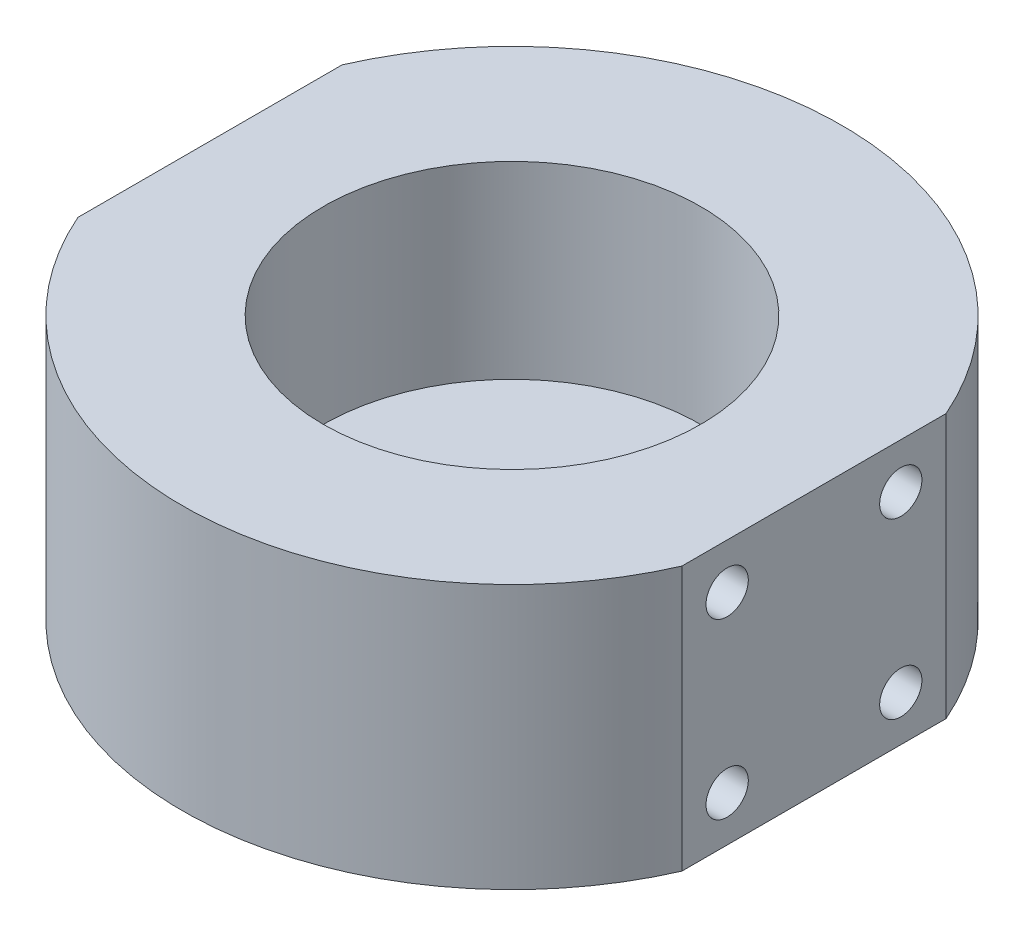
ISO-10303-21;
HEADER;
FILE_DESCRIPTION(('STEP AP214'),'2;1');
FILE_NAME('part.step','',(''),(''),'','','');
FILE_SCHEMA(('AUTOMOTIVE_DESIGN { 1 0 10303 214 1 1 1 1 }'));
ENDSEC;
DATA;
#1=APPLICATION_CONTEXT('core data for automotive mechanical design processes');
#2=APPLICATION_PROTOCOL_DEFINITION('international standard','automotive_design',2000,#1);
#3=PRODUCT_CONTEXT('',#1,'mechanical');
#4=PRODUCT('Part','Part','',(#3));
#5=PRODUCT_RELATED_PRODUCT_CATEGORY('part','',(#4));
#6=PRODUCT_DEFINITION_FORMATION('','',#4);
#7=PRODUCT_DEFINITION_CONTEXT('part definition',#1,'design');
#8=PRODUCT_DEFINITION('design','',#6,#7);
#9=PRODUCT_DEFINITION_SHAPE('','',#8);
#10=(LENGTH_UNIT() NAMED_UNIT(*) SI_UNIT(.MILLI.,.METRE.));
#11=(NAMED_UNIT(*) PLANE_ANGLE_UNIT() SI_UNIT($,.RADIAN.));
#12=(NAMED_UNIT(*) SI_UNIT($,.STERADIAN.) SOLID_ANGLE_UNIT());
#13=UNCERTAINTY_MEASURE_WITH_UNIT(LENGTH_MEASURE(1.E-05),#10,'distance_accuracy_value','');
#14=(GEOMETRIC_REPRESENTATION_CONTEXT(3) GLOBAL_UNCERTAINTY_ASSIGNED_CONTEXT((#13)) GLOBAL_UNIT_ASSIGNED_CONTEXT((#10,
#11,#12)) REPRESENTATION_CONTEXT('',''));
#15=CARTESIAN_POINT('',(0.,0.,0.));
#16=DIRECTION('',(0.,0.,1.));
#17=DIRECTION('',(1.,0.,0.));
#18=AXIS2_PLACEMENT_3D('',#15,#16,#17);
#19=CARTESIAN_POINT('',(0.,0.,-9.));
#20=DIRECTION('',(0.,1.,0.));
#21=DIRECTION('',(0.,0.,1.));
#22=AXIS2_PLACEMENT_3D('',#19,#20,#21);
#23=CYLINDRICAL_SURFACE('',#22,1.69);
#24=CARTESIAN_POINT('',(0.,0.,-9.));
#25=DIRECTION('',(0.,1.,0.));
#26=DIRECTION('',(0.,0.,1.));
#27=AXIS2_PLACEMENT_3D('',#24,#25,#26);
#28=CIRCLE('',#27,1.69);
#29=CARTESIAN_POINT('',(0.,0.,-7.31));
#30=VERTEX_POINT('',#29);
#31=EDGE_CURVE('E172',#30,#30,#28,.T.);
#32=ORIENTED_EDGE('',*,*,#31,.F.);
#33=EDGE_LOOP('',(#32));
#34=FACE_BOUND('',#33,.T.);
#35=CARTESIAN_POINT('',(0.,10.,-9.));
#36=DIRECTION('',(0.,1.,0.));
#37=DIRECTION('',(0.,0.,1.));
#38=AXIS2_PLACEMENT_3D('',#35,#36,#37);
#39=CIRCLE('',#38,1.69);
#40=CARTESIAN_POINT('',(0.,10.,-7.31));
#41=VERTEX_POINT('',#40);
#42=EDGE_CURVE('E179',#41,#41,#39,.F.);
#43=ORIENTED_EDGE('',*,*,#42,.F.);
#44=EDGE_LOOP('',(#43));
#45=FACE_BOUND('',#44,.T.);
#46=ADVANCED_FACE('F41',(#34,#45),#23,.F.);
#47=CARTESIAN_POINT('',(0.,0.,9.));
#48=DIRECTION('',(0.,1.,0.));
#49=DIRECTION('',(0.,0.,1.));
#50=AXIS2_PLACEMENT_3D('',#47,#48,#49);
#51=CYLINDRICAL_SURFACE('',#50,1.69);
#52=CARTESIAN_POINT('',(0.,0.,9.));
#53=DIRECTION('',(0.,1.,0.));
#54=DIRECTION('',(0.,0.,1.));
#55=AXIS2_PLACEMENT_3D('',#52,#53,#54);
#56=CIRCLE('',#55,1.69);
#57=CARTESIAN_POINT('',(0.,0.,10.69));
#58=VERTEX_POINT('',#57);
#59=EDGE_CURVE('E169',#58,#58,#56,.T.);
#60=ORIENTED_EDGE('',*,*,#59,.F.);
#61=EDGE_LOOP('',(#60));
#62=FACE_BOUND('',#61,.T.);
#63=CARTESIAN_POINT('',(0.,10.,9.));
#64=DIRECTION('',(0.,1.,0.));
#65=DIRECTION('',(0.,0.,1.));
#66=AXIS2_PLACEMENT_3D('',#63,#64,#65);
#67=CIRCLE('',#66,1.69);
#68=CARTESIAN_POINT('',(0.,10.,10.69));
#69=VERTEX_POINT('',#68);
#70=EDGE_CURVE('E186',#69,#69,#67,.F.);
#71=ORIENTED_EDGE('',*,*,#70,.F.);
#72=EDGE_LOOP('',(#71));
#73=FACE_BOUND('',#72,.T.);
#74=ADVANCED_FACE('F219',(#62,#73),#51,.F.);
#75=CARTESIAN_POINT('',(-6.,0.,0.));
#76=DIRECTION('',(0.,1.,0.));
#77=DIRECTION('',(0.,0.,1.));
#78=AXIS2_PLACEMENT_3D('',#75,#76,#77);
#79=CYLINDRICAL_SURFACE('',#78,1.69);
#80=CARTESIAN_POINT('',(-6.,0.,0.));
#81=DIRECTION('',(0.,1.,0.));
#82=DIRECTION('',(0.,0.,1.));
#83=AXIS2_PLACEMENT_3D('',#80,#81,#82);
#84=CIRCLE('',#83,1.69);
#85=CARTESIAN_POINT('',(-6.,0.,1.69));
#86=VERTEX_POINT('',#85);
#87=EDGE_CURVE('E173',#86,#86,#84,.T.);
#88=ORIENTED_EDGE('',*,*,#87,.F.);
#89=EDGE_LOOP('',(#88));
#90=FACE_BOUND('',#89,.T.);
#91=CARTESIAN_POINT('',(-6.,10.,0.));
#92=DIRECTION('',(0.,1.,0.));
#93=DIRECTION('',(0.,0.,1.));
#94=AXIS2_PLACEMENT_3D('',#91,#92,#93);
#95=CIRCLE('',#94,1.69);
#96=CARTESIAN_POINT('',(-6.,10.,1.69));
#97=VERTEX_POINT('',#96);
#98=EDGE_CURVE('E189',#97,#97,#95,.F.);
#99=ORIENTED_EDGE('',*,*,#98,.F.);
#100=EDGE_LOOP('',(#99));
#101=FACE_BOUND('',#100,.T.);
#102=ADVANCED_FACE('F225',(#90,#101),#79,.F.);
#103=CARTESIAN_POINT('',(0.,0.,0.));
#104=DIRECTION('',(0.,1.,0.));
#105=DIRECTION('',(0.,0.,1.));
#106=AXIS2_PLACEMENT_3D('',#103,#104,#105);
#107=CYLINDRICAL_SURFACE('',#106,2.25);
#108=CARTESIAN_POINT('',(0.,0.,0.));
#109=DIRECTION('',(0.,1.,0.));
#110=DIRECTION('',(0.,0.,1.));
#111=AXIS2_PLACEMENT_3D('',#108,#109,#110);
#112=CIRCLE('',#111,2.25);
#113=CARTESIAN_POINT('',(0.,0.,2.25));
#114=VERTEX_POINT('',#113);
#115=EDGE_CURVE('E176',#114,#114,#112,.T.);
#116=ORIENTED_EDGE('',*,*,#115,.F.);
#117=EDGE_LOOP('',(#116));
#118=FACE_BOUND('',#117,.T.);
#119=CARTESIAN_POINT('',(0.,10.,0.));
#120=DIRECTION('',(0.,1.,0.));
#121=DIRECTION('',(0.,0.,1.));
#122=AXIS2_PLACEMENT_3D('',#119,#120,#121);
#123=CIRCLE('',#122,2.25);
#124=CARTESIAN_POINT('',(0.,10.,2.25));
#125=VERTEX_POINT('',#124);
#126=EDGE_CURVE('E192',#125,#125,#123,.F.);
#127=ORIENTED_EDGE('',*,*,#126,.F.);
#128=EDGE_LOOP('',(#127));
#129=FACE_BOUND('',#128,.T.);
#130=ADVANCED_FACE('F231',(#118,#129),#107,.F.);
#131=CARTESIAN_POINT('',(6.,0.,0.));
#132=DIRECTION('',(0.,1.,0.));
#133=DIRECTION('',(0.,0.,1.));
#134=AXIS2_PLACEMENT_3D('',#131,#132,#133);
#135=CYLINDRICAL_SURFACE('',#134,1.69);
#136=CARTESIAN_POINT('',(6.,0.,0.));
#137=DIRECTION('',(0.,1.,0.));
#138=DIRECTION('',(0.,0.,1.));
#139=AXIS2_PLACEMENT_3D('',#136,#137,#138);
#140=CIRCLE('',#139,1.69);
#141=CARTESIAN_POINT('',(6.,0.,1.69));
#142=VERTEX_POINT('',#141);
#143=EDGE_CURVE('E166',#142,#142,#140,.T.);
#144=ORIENTED_EDGE('',*,*,#143,.F.);
#145=EDGE_LOOP('',(#144));
#146=FACE_BOUND('',#145,.T.);
#147=CARTESIAN_POINT('',(6.,10.,0.));
#148=DIRECTION('',(0.,1.,0.));
#149=DIRECTION('',(0.,0.,1.));
#150=AXIS2_PLACEMENT_3D('',#147,#148,#149);
#151=CIRCLE('',#150,1.69);
#152=CARTESIAN_POINT('',(6.,10.,1.69));
#153=VERTEX_POINT('',#152);
#154=EDGE_CURVE('E45',#153,#153,#151,.F.);
#155=ORIENTED_EDGE('',*,*,#154,.F.);
#156=EDGE_LOOP('',(#155));
#157=FACE_BOUND('',#156,.T.);
#158=ADVANCED_FACE('F309',(#146,#157),#135,.F.);
#159=CARTESIAN_POINT('',(0.,35.,0.));
#160=DIRECTION('',(0.,-1.,0.));
#161=DIRECTION('',(0.,0.,-1.));
#162=AXIS2_PLACEMENT_3D('',#159,#160,#161);
#163=CYLINDRICAL_SURFACE('',#162,43.6606229914324);
#164=CARTESIAN_POINT('',(0.,0.,0.));
#165=DIRECTION('',(0.,1.,0.));
#166=DIRECTION('',(0.,0.,1.));
#167=AXIS2_PLACEMENT_3D('',#164,#165,#166);
#168=CIRCLE('',#167,43.6606229914324);
#169=CARTESIAN_POINT('',(40.,0.,-17.5));
#170=VERTEX_POINT('',#169);
#171=CARTESIAN_POINT('',(-40.,0.,-17.5));
#172=VERTEX_POINT('',#171);
#173=EDGE_CURVE('E107',#170,#172,#168,.T.);
#174=ORIENTED_EDGE('',*,*,#173,.T.);
#175=DIRECTION('',(0.,-1.,0.));
#176=VECTOR('',#175,1.);
#177=CARTESIAN_POINT('',(-40.,35.,-17.5));
#178=LINE('',#177,#176);
#179=CARTESIAN_POINT('',(-40.,35.,-17.5));
#180=VERTEX_POINT('',#179);
#181=EDGE_CURVE('E12',#180,#172,#178,.T.);
#182=ORIENTED_EDGE('',*,*,#181,.F.);
#183=CARTESIAN_POINT('',(0.,35.,0.));
#184=DIRECTION('',(0.,1.,0.));
#185=DIRECTION('',(0.,0.,1.));
#186=AXIS2_PLACEMENT_3D('',#183,#184,#185);
#187=CIRCLE('',#186,43.6606229914324);
#188=CARTESIAN_POINT('',(40.,35.,-17.5));
#189=VERTEX_POINT('',#188);
#190=EDGE_CURVE('E94',#189,#180,#187,.T.);
#191=ORIENTED_EDGE('',*,*,#190,.F.);
#192=DIRECTION('',(0.,-1.,0.));
#193=VECTOR('',#192,1.);
#194=CARTESIAN_POINT('',(40.,35.,-17.5));
#195=LINE('',#194,#193);
#196=EDGE_CURVE('E103',#189,#170,#195,.T.);
#197=ORIENTED_EDGE('',*,*,#196,.T.);
#198=EDGE_LOOP('',(#174,#182,#191,#197));
#199=FACE_BOUND('',#198,.T.);
#200=ADVANCED_FACE('F43',(#199),#163,.T.);
#201=CARTESIAN_POINT('',(-40.,35.,-17.5));
#202=DIRECTION('',(1.,0.,0.));
#203=DIRECTION('',(0.,0.,-1.));
#204=AXIS2_PLACEMENT_3D('',#201,#202,#203);
#205=PLANE('',#204);
#206=CARTESIAN_POINT('',(-40.,29.,11.5));
#207=DIRECTION('',(-1.,0.,0.));
#208=DIRECTION('',(0.,0.,1.));
#209=AXIS2_PLACEMENT_3D('',#206,#207,#208);
#210=CIRCLE('',#209,2.8);
#211=CARTESIAN_POINT('',(-40.,29.,14.3));
#212=VERTEX_POINT('',#211);
#213=EDGE_CURVE('E124',#212,#212,#210,.T.);
#214=ORIENTED_EDGE('',*,*,#213,.F.);
#215=EDGE_LOOP('',(#214));
#216=FACE_BOUND('',#215,.T.);
#217=CARTESIAN_POINT('',(-40.,6.,-11.5));
#218=DIRECTION('',(-1.,0.,0.));
#219=DIRECTION('',(0.,0.,1.));
#220=AXIS2_PLACEMENT_3D('',#217,#218,#219);
#221=CIRCLE('',#220,2.8);
#222=CARTESIAN_POINT('',(-40.,6.,-8.7));
#223=VERTEX_POINT('',#222);
#224=EDGE_CURVE('E130',#223,#223,#221,.T.);
#225=ORIENTED_EDGE('',*,*,#224,.F.);
#226=EDGE_LOOP('',(#225));
#227=FACE_BOUND('',#226,.T.);
#228=CARTESIAN_POINT('',(-40.,6.,11.5));
#229=DIRECTION('',(-1.,0.,0.));
#230=DIRECTION('',(0.,0.,1.));
#231=AXIS2_PLACEMENT_3D('',#228,#229,#230);
#232=CIRCLE('',#231,2.8);
#233=CARTESIAN_POINT('',(-40.,6.,14.3));
#234=VERTEX_POINT('',#233);
#235=EDGE_CURVE('E131',#234,#234,#232,.T.);
#236=ORIENTED_EDGE('',*,*,#235,.F.);
#237=EDGE_LOOP('',(#236));
#238=FACE_BOUND('',#237,.T.);
#239=CARTESIAN_POINT('',(-40.,29.,-11.5));
#240=DIRECTION('',(-1.,0.,0.));
#241=DIRECTION('',(0.,0.,1.));
#242=AXIS2_PLACEMENT_3D('',#239,#240,#241);
#243=CIRCLE('',#242,2.8);
#244=CARTESIAN_POINT('',(-40.,29.,-8.7));
#245=VERTEX_POINT('',#244);
#246=EDGE_CURVE('E121',#245,#245,#243,.T.);
#247=ORIENTED_EDGE('',*,*,#246,.F.);
#248=EDGE_LOOP('',(#247));
#249=FACE_BOUND('',#248,.T.);
#250=DIRECTION('',(0.,0.,1.));
#251=VECTOR('',#250,1.);
#252=CARTESIAN_POINT('',(-40.,0.,-17.5));
#253=LINE('',#252,#251);
#254=CARTESIAN_POINT('',(-40.,0.,17.5));
#255=VERTEX_POINT('',#254);
#256=EDGE_CURVE('E98',#172,#255,#253,.T.);
#257=ORIENTED_EDGE('',*,*,#256,.T.);
#258=DIRECTION('',(0.,-1.,0.));
#259=VECTOR('',#258,1.);
#260=CARTESIAN_POINT('',(-40.,35.,17.5));
#261=LINE('',#260,#259);
#262=CARTESIAN_POINT('',(-40.,35.,17.5));
#263=VERTEX_POINT('',#262);
#264=EDGE_CURVE('E51',#263,#255,#261,.T.);
#265=ORIENTED_EDGE('',*,*,#264,.F.);
#266=DIRECTION('',(0.,0.,1.));
#267=VECTOR('',#266,1.);
#268=CARTESIAN_POINT('',(-40.,35.,-17.5));
#269=LINE('',#268,#267);
#270=EDGE_CURVE('E89',#180,#263,#269,.T.);
#271=ORIENTED_EDGE('',*,*,#270,.F.);
#272=ORIENTED_EDGE('',*,*,#181,.T.);
#273=EDGE_LOOP('',(#257,#265,#271,#272));
#274=FACE_BOUND('',#273,.T.);
#275=ADVANCED_FACE('F97',(#216,#227,#238,#249,#274),#205,.F.);
#276=CARTESIAN_POINT('',(0.,35.,0.));
#277=DIRECTION('',(0.,-1.,0.));
#278=DIRECTION('',(0.,0.,-1.));
#279=AXIS2_PLACEMENT_3D('',#276,#277,#278);
#280=CYLINDRICAL_SURFACE('',#279,43.6606229914324);
#281=CARTESIAN_POINT('',(0.,0.,0.));
#282=DIRECTION('',(0.,1.,0.));
#283=DIRECTION('',(0.,0.,1.));
#284=AXIS2_PLACEMENT_3D('',#281,#282,#283);
#285=CIRCLE('',#284,43.6606229914324);
#286=CARTESIAN_POINT('',(40.,0.,17.5));
#287=VERTEX_POINT('',#286);
#288=EDGE_CURVE('E76',#255,#287,#285,.T.);
#289=ORIENTED_EDGE('',*,*,#288,.T.);
#290=DIRECTION('',(0.,-1.,0.));
#291=VECTOR('',#290,1.);
#292=CARTESIAN_POINT('',(40.,35.,17.5));
#293=LINE('',#292,#291);
#294=CARTESIAN_POINT('',(40.,35.,17.5));
#295=VERTEX_POINT('',#294);
#296=EDGE_CURVE('E99',#295,#287,#293,.T.);
#297=ORIENTED_EDGE('',*,*,#296,.F.);
#298=CARTESIAN_POINT('',(0.,35.,0.));
#299=DIRECTION('',(0.,1.,0.));
#300=DIRECTION('',(0.,0.,1.));
#301=AXIS2_PLACEMENT_3D('',#298,#299,#300);
#302=CIRCLE('',#301,43.6606229914324);
#303=EDGE_CURVE('E92',#263,#295,#302,.T.);
#304=ORIENTED_EDGE('',*,*,#303,.F.);
#305=ORIENTED_EDGE('',*,*,#264,.T.);
#306=EDGE_LOOP('',(#289,#297,#304,#305));
#307=FACE_BOUND('',#306,.T.);
#308=ADVANCED_FACE('F101',(#307),#280,.T.);
#309=CARTESIAN_POINT('',(40.,35.,-17.5));
#310=DIRECTION('',(-1.,0.,0.));
#311=DIRECTION('',(0.,0.,1.));
#312=AXIS2_PLACEMENT_3D('',#309,#310,#311);
#313=PLANE('',#312);
#314=CARTESIAN_POINT('',(40.,29.,11.5));
#315=DIRECTION('',(-1.,0.,0.));
#316=DIRECTION('',(0.,0.,1.));
#317=AXIS2_PLACEMENT_3D('',#314,#315,#316);
#318=CIRCLE('',#317,2.8);
#319=CARTESIAN_POINT('',(40.,29.,14.3));
#320=VERTEX_POINT('',#319);
#321=EDGE_CURVE('E158',#320,#320,#318,.T.);
#322=ORIENTED_EDGE('',*,*,#321,.T.);
#323=EDGE_LOOP('',(#322));
#324=FACE_BOUND('',#323,.T.);
#325=CARTESIAN_POINT('',(40.,6.,-11.5));
#326=DIRECTION('',(-1.,0.,0.));
#327=DIRECTION('',(0.,0.,1.));
#328=AXIS2_PLACEMENT_3D('',#325,#326,#327);
#329=CIRCLE('',#328,2.8);
#330=CARTESIAN_POINT('',(40.,6.,-8.7));
#331=VERTEX_POINT('',#330);
#332=EDGE_CURVE('E151',#331,#331,#329,.T.);
#333=ORIENTED_EDGE('',*,*,#332,.T.);
#334=EDGE_LOOP('',(#333));
#335=FACE_BOUND('',#334,.T.);
#336=CARTESIAN_POINT('',(40.,6.,11.5));
#337=DIRECTION('',(-1.,0.,0.));
#338=DIRECTION('',(0.,0.,1.));
#339=AXIS2_PLACEMENT_3D('',#336,#337,#338);
#340=CIRCLE('',#339,2.8);
#341=CARTESIAN_POINT('',(40.,6.,14.3));
#342=VERTEX_POINT('',#341);
#343=EDGE_CURVE('E163',#342,#342,#340,.T.);
#344=ORIENTED_EDGE('',*,*,#343,.T.);
#345=EDGE_LOOP('',(#344));
#346=FACE_BOUND('',#345,.T.);
#347=CARTESIAN_POINT('',(40.,29.,-11.5));
#348=DIRECTION('',(-1.,0.,0.));
#349=DIRECTION('',(0.,0.,1.));
#350=AXIS2_PLACEMENT_3D('',#347,#348,#349);
#351=CIRCLE('',#350,2.8);
#352=CARTESIAN_POINT('',(40.,29.,-8.7));
#353=VERTEX_POINT('',#352);
#354=EDGE_CURVE('E145',#353,#353,#351,.T.);
#355=ORIENTED_EDGE('',*,*,#354,.T.);
#356=EDGE_LOOP('',(#355));
#357=FACE_BOUND('',#356,.T.);
#358=DIRECTION('',(0.,0.,-1.));
#359=VECTOR('',#358,1.);
#360=CARTESIAN_POINT('',(40.,0.,-17.5));
#361=LINE('',#360,#359);
#362=EDGE_CURVE('E82',#287,#170,#361,.T.);
#363=ORIENTED_EDGE('',*,*,#362,.T.);
#364=ORIENTED_EDGE('',*,*,#196,.F.);
#365=DIRECTION('',(0.,0.,-1.));
#366=VECTOR('',#365,1.);
#367=CARTESIAN_POINT('',(40.,35.,-17.5));
#368=LINE('',#367,#366);
#369=EDGE_CURVE('E59',#295,#189,#368,.T.);
#370=ORIENTED_EDGE('',*,*,#369,.F.);
#371=ORIENTED_EDGE('',*,*,#296,.T.);
#372=EDGE_LOOP('',(#363,#364,#370,#371));
#373=FACE_BOUND('',#372,.T.);
#374=ADVANCED_FACE('F115',(#324,#335,#346,#357,#373),#313,.F.);
#375=CARTESIAN_POINT('',(0.,35.,0.));
#376=DIRECTION('',(0.,1.,0.));
#377=DIRECTION('',(0.,0.,1.));
#378=AXIS2_PLACEMENT_3D('',#375,#376,#377);
#379=PLANE('',#378);
#380=CARTESIAN_POINT('',(0.,35.,0.));
#381=DIRECTION('',(0.,1.,0.));
#382=DIRECTION('',(0.,0.,1.));
#383=AXIS2_PLACEMENT_3D('',#380,#381,#382);
#384=CIRCLE('',#383,25.);
#385=CARTESIAN_POINT('',(0.,35.,25.));
#386=VERTEX_POINT('',#385);
#387=EDGE_CURVE('E198',#386,#386,#384,.T.);
#388=ORIENTED_EDGE('',*,*,#387,.F.);
#389=EDGE_LOOP('',(#388));
#390=FACE_BOUND('',#389,.T.);
#391=ORIENTED_EDGE('',*,*,#190,.T.);
#392=ORIENTED_EDGE('',*,*,#270,.T.);
#393=ORIENTED_EDGE('',*,*,#303,.T.);
#394=ORIENTED_EDGE('',*,*,#369,.T.);
#395=EDGE_LOOP('',(#391,#392,#393,#394));
#396=FACE_BOUND('',#395,.T.);
#397=ADVANCED_FACE('F90',(#390,#396),#379,.T.);
#398=CARTESIAN_POINT('',(0.,0.,0.));
#399=DIRECTION('',(0.,1.,0.));
#400=DIRECTION('',(0.,0.,1.));
#401=AXIS2_PLACEMENT_3D('',#398,#399,#400);
#402=PLANE('',#401);
#403=ORIENTED_EDGE('',*,*,#143,.T.);
#404=EDGE_LOOP('',(#403));
#405=FACE_BOUND('',#404,.T.);
#406=ORIENTED_EDGE('',*,*,#115,.T.);
#407=EDGE_LOOP('',(#406));
#408=FACE_BOUND('',#407,.T.);
#409=ORIENTED_EDGE('',*,*,#87,.T.);
#410=EDGE_LOOP('',(#409));
#411=FACE_BOUND('',#410,.T.);
#412=ORIENTED_EDGE('',*,*,#59,.T.);
#413=EDGE_LOOP('',(#412));
#414=FACE_BOUND('',#413,.T.);
#415=ORIENTED_EDGE('',*,*,#31,.T.);
#416=EDGE_LOOP('',(#415));
#417=FACE_BOUND('',#416,.T.);
#418=ORIENTED_EDGE('',*,*,#173,.F.);
#419=ORIENTED_EDGE('',*,*,#362,.F.);
#420=ORIENTED_EDGE('',*,*,#288,.F.);
#421=ORIENTED_EDGE('',*,*,#256,.F.);
#422=EDGE_LOOP('',(#418,#419,#420,#421));
#423=FACE_BOUND('',#422,.T.);
#424=ADVANCED_FACE('F118',(#405,#408,#411,#414,#417,#423),#402,.F.);
#425=CARTESIAN_POINT('',(-30.,29.,-11.5));
#426=DIRECTION('',(-1.,0.,0.));
#427=DIRECTION('',(0.,0.,1.));
#428=AXIS2_PLACEMENT_3D('',#425,#426,#427);
#429=CYLINDRICAL_SURFACE('',#428,2.8);
#430=CARTESIAN_POINT('',(-30.,29.,-11.5));
#431=DIRECTION('',(-1.,0.,0.));
#432=DIRECTION('',(0.,0.,1.));
#433=AXIS2_PLACEMENT_3D('',#430,#431,#432);
#434=CIRCLE('',#433,2.8);
#435=CARTESIAN_POINT('',(-30.,29.,-8.7));
#436=VERTEX_POINT('',#435);
#437=EDGE_CURVE('E110',#436,#436,#434,.T.);
#438=ORIENTED_EDGE('',*,*,#437,.F.);
#439=EDGE_LOOP('',(#438));
#440=FACE_BOUND('',#439,.T.);
#441=ORIENTED_EDGE('',*,*,#246,.T.);
#442=EDGE_LOOP('',(#441));
#443=FACE_BOUND('',#442,.T.);
#444=ADVANCED_FACE('F211',(#440,#443),#429,.F.);
#445=CARTESIAN_POINT('',(-30.,29.,-11.5));
#446=DIRECTION('',(-1.,0.,0.));
#447=DIRECTION('',(0.,0.,1.));
#448=AXIS2_PLACEMENT_3D('',#445,#446,#447);
#449=PLANE('',#448);
#450=ORIENTED_EDGE('',*,*,#437,.T.);
#451=EDGE_LOOP('',(#450));
#452=FACE_BOUND('',#451,.T.);
#453=ADVANCED_FACE('F272',(#452),#449,.T.);
#454=CARTESIAN_POINT('',(-30.,6.,11.5));
#455=DIRECTION('',(-1.,0.,0.));
#456=DIRECTION('',(0.,0.,1.));
#457=AXIS2_PLACEMENT_3D('',#454,#455,#456);
#458=CYLINDRICAL_SURFACE('',#457,2.8);
#459=CARTESIAN_POINT('',(-30.,6.,11.5));
#460=DIRECTION('',(-1.,0.,0.));
#461=DIRECTION('',(0.,0.,1.));
#462=AXIS2_PLACEMENT_3D('',#459,#460,#461);
#463=CIRCLE('',#462,2.8);
#464=CARTESIAN_POINT('',(-30.,6.,14.3));
#465=VERTEX_POINT('',#464);
#466=EDGE_CURVE('E139',#465,#465,#463,.T.);
#467=ORIENTED_EDGE('',*,*,#466,.F.);
#468=EDGE_LOOP('',(#467));
#469=FACE_BOUND('',#468,.T.);
#470=ORIENTED_EDGE('',*,*,#235,.T.);
#471=EDGE_LOOP('',(#470));
#472=FACE_BOUND('',#471,.T.);
#473=ADVANCED_FACE('F268',(#469,#472),#458,.F.);
#474=CARTESIAN_POINT('',(-30.,6.,11.5));
#475=DIRECTION('',(-1.,0.,0.));
#476=DIRECTION('',(0.,0.,1.));
#477=AXIS2_PLACEMENT_3D('',#474,#475,#476);
#478=PLANE('',#477);
#479=ORIENTED_EDGE('',*,*,#466,.T.);
#480=EDGE_LOOP('',(#479));
#481=FACE_BOUND('',#480,.T.);
#482=ADVANCED_FACE('F271',(#481),#478,.T.);
#483=CARTESIAN_POINT('',(-30.,6.,-11.5));
#484=DIRECTION('',(-1.,0.,0.));
#485=DIRECTION('',(0.,0.,1.));
#486=AXIS2_PLACEMENT_3D('',#483,#484,#485);
#487=CYLINDRICAL_SURFACE('',#486,2.8);
#488=CARTESIAN_POINT('',(-30.,6.,-11.5));
#489=DIRECTION('',(-1.,0.,0.));
#490=DIRECTION('',(0.,0.,1.));
#491=AXIS2_PLACEMENT_3D('',#488,#489,#490);
#492=CIRCLE('',#491,2.8);
#493=CARTESIAN_POINT('',(-30.,6.,-8.7));
#494=VERTEX_POINT('',#493);
#495=EDGE_CURVE('E127',#494,#494,#492,.T.);
#496=ORIENTED_EDGE('',*,*,#495,.F.);
#497=EDGE_LOOP('',(#496));
#498=FACE_BOUND('',#497,.T.);
#499=ORIENTED_EDGE('',*,*,#224,.T.);
#500=EDGE_LOOP('',(#499));
#501=FACE_BOUND('',#500,.T.);
#502=ADVANCED_FACE('F276',(#498,#501),#487,.F.);
#503=CARTESIAN_POINT('',(-30.,6.,-11.5));
#504=DIRECTION('',(-1.,0.,0.));
#505=DIRECTION('',(0.,0.,1.));
#506=AXIS2_PLACEMENT_3D('',#503,#504,#505);
#507=PLANE('',#506);
#508=ORIENTED_EDGE('',*,*,#495,.T.);
#509=EDGE_LOOP('',(#508));
#510=FACE_BOUND('',#509,.T.);
#511=ADVANCED_FACE('F281',(#510),#507,.T.);
#512=CARTESIAN_POINT('',(-30.,29.,11.5));
#513=DIRECTION('',(-1.,0.,0.));
#514=DIRECTION('',(0.,0.,1.));
#515=AXIS2_PLACEMENT_3D('',#512,#513,#514);
#516=CYLINDRICAL_SURFACE('',#515,2.8);
#517=CARTESIAN_POINT('',(-30.,29.,11.5));
#518=DIRECTION('',(-1.,0.,0.));
#519=DIRECTION('',(0.,0.,1.));
#520=AXIS2_PLACEMENT_3D('',#517,#518,#519);
#521=CIRCLE('',#520,2.8);
#522=CARTESIAN_POINT('',(-30.,29.,14.3));
#523=VERTEX_POINT('',#522);
#524=EDGE_CURVE('E134',#523,#523,#521,.T.);
#525=ORIENTED_EDGE('',*,*,#524,.F.);
#526=EDGE_LOOP('',(#525));
#527=FACE_BOUND('',#526,.T.);
#528=ORIENTED_EDGE('',*,*,#213,.T.);
#529=EDGE_LOOP('',(#528));
#530=FACE_BOUND('',#529,.T.);
#531=ADVANCED_FACE('F278',(#527,#530),#516,.F.);
#532=CARTESIAN_POINT('',(-30.,29.,11.5));
#533=DIRECTION('',(-1.,0.,0.));
#534=DIRECTION('',(0.,0.,1.));
#535=AXIS2_PLACEMENT_3D('',#532,#533,#534);
#536=PLANE('',#535);
#537=ORIENTED_EDGE('',*,*,#524,.T.);
#538=EDGE_LOOP('',(#537));
#539=FACE_BOUND('',#538,.T.);
#540=ADVANCED_FACE('F266',(#539),#536,.T.);
#541=CARTESIAN_POINT('',(30.,29.,-11.5));
#542=DIRECTION('',(1.,0.,0.));
#543=DIRECTION('',(0.,0.,-1.));
#544=AXIS2_PLACEMENT_3D('',#541,#542,#543);
#545=CYLINDRICAL_SURFACE('',#544,2.8);
#546=CARTESIAN_POINT('',(30.,29.,-11.5));
#547=DIRECTION('',(-1.,0.,0.));
#548=DIRECTION('',(0.,0.,1.));
#549=AXIS2_PLACEMENT_3D('',#546,#547,#548);
#550=CIRCLE('',#549,2.8);
#551=CARTESIAN_POINT('',(30.,29.,-8.7));
#552=VERTEX_POINT('',#551);
#553=EDGE_CURVE('E142',#552,#552,#550,.T.);
#554=ORIENTED_EDGE('',*,*,#553,.T.);
#555=EDGE_LOOP('',(#554));
#556=FACE_BOUND('',#555,.T.);
#557=ORIENTED_EDGE('',*,*,#354,.F.);
#558=EDGE_LOOP('',(#557));
#559=FACE_BOUND('',#558,.T.);
#560=ADVANCED_FACE('F262',(#556,#559),#545,.F.);
#561=CARTESIAN_POINT('',(30.,29.,-11.5));
#562=DIRECTION('',(-1.,0.,0.));
#563=DIRECTION('',(0.,0.,1.));
#564=AXIS2_PLACEMENT_3D('',#561,#562,#563);
#565=PLANE('',#564);
#566=ORIENTED_EDGE('',*,*,#553,.F.);
#567=EDGE_LOOP('',(#566));
#568=FACE_BOUND('',#567,.T.);
#569=ADVANCED_FACE('F242',(#568),#565,.F.);
#570=CARTESIAN_POINT('',(30.,6.,11.5));
#571=DIRECTION('',(1.,0.,0.));
#572=DIRECTION('',(0.,0.,-1.));
#573=AXIS2_PLACEMENT_3D('',#570,#571,#572);
#574=CYLINDRICAL_SURFACE('',#573,2.8);
#575=CARTESIAN_POINT('',(30.,6.,11.5));
#576=DIRECTION('',(-1.,0.,0.));
#577=DIRECTION('',(0.,0.,1.));
#578=AXIS2_PLACEMENT_3D('',#575,#576,#577);
#579=CIRCLE('',#578,2.8);
#580=CARTESIAN_POINT('',(30.,6.,14.3));
#581=VERTEX_POINT('',#580);
#582=EDGE_CURVE('E155',#581,#581,#579,.T.);
#583=ORIENTED_EDGE('',*,*,#582,.T.);
#584=EDGE_LOOP('',(#583));
#585=FACE_BOUND('',#584,.T.);
#586=ORIENTED_EDGE('',*,*,#343,.F.);
#587=EDGE_LOOP('',(#586));
#588=FACE_BOUND('',#587,.T.);
#589=ADVANCED_FACE('F238',(#585,#588),#574,.F.);
#590=CARTESIAN_POINT('',(30.,6.,11.5));
#591=DIRECTION('',(-1.,0.,0.));
#592=DIRECTION('',(0.,0.,1.));
#593=AXIS2_PLACEMENT_3D('',#590,#591,#592);
#594=PLANE('',#593);
#595=ORIENTED_EDGE('',*,*,#582,.F.);
#596=EDGE_LOOP('',(#595));
#597=FACE_BOUND('',#596,.T.);
#598=ADVANCED_FACE('F234',(#597),#594,.F.);
#599=CARTESIAN_POINT('',(30.,6.,-11.5));
#600=DIRECTION('',(1.,0.,0.));
#601=DIRECTION('',(0.,0.,-1.));
#602=AXIS2_PLACEMENT_3D('',#599,#600,#601);
#603=CYLINDRICAL_SURFACE('',#602,2.8);
#604=CARTESIAN_POINT('',(30.,6.,-11.5));
#605=DIRECTION('',(-1.,0.,0.));
#606=DIRECTION('',(0.,0.,1.));
#607=AXIS2_PLACEMENT_3D('',#604,#605,#606);
#608=CIRCLE('',#607,2.8);
#609=CARTESIAN_POINT('',(30.,6.,-8.7));
#610=VERTEX_POINT('',#609);
#611=EDGE_CURVE('E154',#610,#610,#608,.T.);
#612=ORIENTED_EDGE('',*,*,#611,.T.);
#613=EDGE_LOOP('',(#612));
#614=FACE_BOUND('',#613,.T.);
#615=ORIENTED_EDGE('',*,*,#332,.F.);
#616=EDGE_LOOP('',(#615));
#617=FACE_BOUND('',#616,.T.);
#618=ADVANCED_FACE('F237',(#614,#617),#603,.F.);
#619=CARTESIAN_POINT('',(30.,6.,-11.5));
#620=DIRECTION('',(-1.,0.,0.));
#621=DIRECTION('',(0.,0.,1.));
#622=AXIS2_PLACEMENT_3D('',#619,#620,#621);
#623=PLANE('',#622);
#624=ORIENTED_EDGE('',*,*,#611,.F.);
#625=EDGE_LOOP('',(#624));
#626=FACE_BOUND('',#625,.T.);
#627=ADVANCED_FACE('F252',(#626),#623,.F.);
#628=CARTESIAN_POINT('',(30.,29.,11.5));
#629=DIRECTION('',(1.,0.,0.));
#630=DIRECTION('',(0.,0.,-1.));
#631=AXIS2_PLACEMENT_3D('',#628,#629,#630);
#632=CYLINDRICAL_SURFACE('',#631,2.8);
#633=CARTESIAN_POINT('',(30.,29.,11.5));
#634=DIRECTION('',(-1.,0.,0.));
#635=DIRECTION('',(0.,0.,1.));
#636=AXIS2_PLACEMENT_3D('',#633,#634,#635);
#637=CIRCLE('',#636,2.8);
#638=CARTESIAN_POINT('',(30.,29.,14.3));
#639=VERTEX_POINT('',#638);
#640=EDGE_CURVE('E148',#639,#639,#637,.T.);
#641=ORIENTED_EDGE('',*,*,#640,.T.);
#642=EDGE_LOOP('',(#641));
#643=FACE_BOUND('',#642,.T.);
#644=ORIENTED_EDGE('',*,*,#321,.F.);
#645=EDGE_LOOP('',(#644));
#646=FACE_BOUND('',#645,.T.);
#647=ADVANCED_FACE('F248',(#643,#646),#632,.F.);
#648=CARTESIAN_POINT('',(30.,29.,11.5));
#649=DIRECTION('',(-1.,0.,0.));
#650=DIRECTION('',(0.,0.,1.));
#651=AXIS2_PLACEMENT_3D('',#648,#649,#650);
#652=PLANE('',#651);
#653=ORIENTED_EDGE('',*,*,#640,.F.);
#654=EDGE_LOOP('',(#653));
#655=FACE_BOUND('',#654,.T.);
#656=ADVANCED_FACE('F244',(#655),#652,.F.);
#657=CARTESIAN_POINT('',(0.,10.,0.));
#658=DIRECTION('',(0.,1.,0.));
#659=DIRECTION('',(0.,0.,1.));
#660=AXIS2_PLACEMENT_3D('',#657,#658,#659);
#661=PLANE('',#660);
#662=CARTESIAN_POINT('',(0.,9.99999999999999,0.));
#663=DIRECTION('',(0.,1.,0.));
#664=DIRECTION('',(0.,0.,1.));
#665=AXIS2_PLACEMENT_3D('',#662,#663,#664);
#666=CIRCLE('',#665,25.);
#667=CARTESIAN_POINT('',(0.,9.99999999999999,25.));
#668=VERTEX_POINT('',#667);
#669=EDGE_CURVE('E195',#668,#668,#666,.F.);
#670=ORIENTED_EDGE('',*,*,#669,.F.);
#671=EDGE_LOOP('',(#670));
#672=FACE_BOUND('',#671,.T.);
#673=ORIENTED_EDGE('',*,*,#154,.T.);
#674=EDGE_LOOP('',(#673));
#675=FACE_BOUND('',#674,.T.);
#676=ORIENTED_EDGE('',*,*,#126,.T.);
#677=EDGE_LOOP('',(#676));
#678=FACE_BOUND('',#677,.T.);
#679=ORIENTED_EDGE('',*,*,#98,.T.);
#680=EDGE_LOOP('',(#679));
#681=FACE_BOUND('',#680,.T.);
#682=ORIENTED_EDGE('',*,*,#70,.T.);
#683=EDGE_LOOP('',(#682));
#684=FACE_BOUND('',#683,.T.);
#685=ORIENTED_EDGE('',*,*,#42,.T.);
#686=EDGE_LOOP('',(#685));
#687=FACE_BOUND('',#686,.T.);
#688=ADVANCED_FACE('F247',(#672,#675,#678,#681,#684,#687),#661,.T.);
#689=CARTESIAN_POINT('',(0.,-70.7106781186548,0.));
#690=DIRECTION('',(0.,1.,0.));
#691=DIRECTION('',(0.,0.,1.));
#692=AXIS2_PLACEMENT_3D('',#689,#690,#691);
#693=CYLINDRICAL_SURFACE('',#692,25.);
#694=ORIENTED_EDGE('',*,*,#669,.T.);
#695=EDGE_LOOP('',(#694));
#696=FACE_BOUND('',#695,.T.);
#697=ORIENTED_EDGE('',*,*,#387,.T.);
#698=EDGE_LOOP('',(#697));
#699=FACE_BOUND('',#698,.T.);
#700=ADVANCED_FACE('F202',(#696,#699),#693,.F.);
#701=CLOSED_SHELL('',(#46,#74,#102,#130,#158,#200,#275,#308,#374,#397,#424,#444,#453,#473,#482,
#502,#511,#531,#540,#560,#569,#589,#598,#618,#627,#647,#656,#688,#700));
#702=MANIFOLD_SOLID_BREP('B2',#701);
#703=ADVANCED_BREP_SHAPE_REPRESENTATION('',(#18,#702),#14);
#704=SHAPE_DEFINITION_REPRESENTATION(#9,#703);
ENDSEC;
END-ISO-10303-21;
